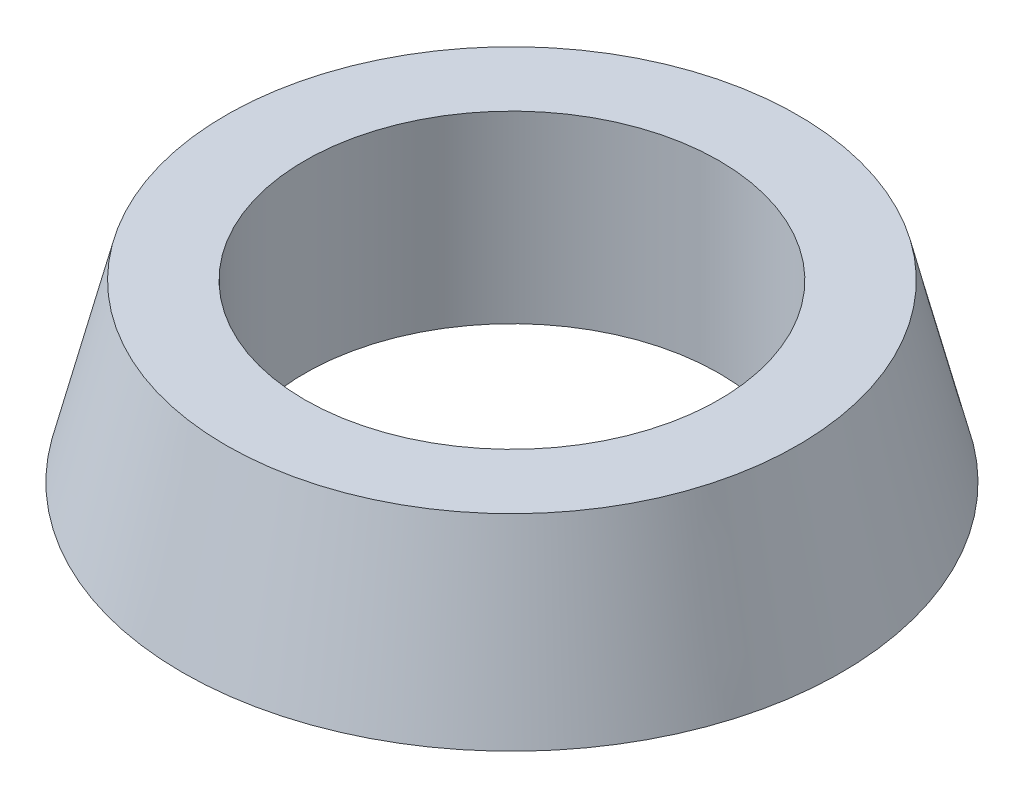
ISO-10303-21;
HEADER;
FILE_DESCRIPTION(('STEP AP214'),'2;1');
FILE_NAME('part.step','',(''),(''),'','','');
FILE_SCHEMA(('AUTOMOTIVE_DESIGN { 1 0 10303 214 1 1 1 1 }'));
ENDSEC;
DATA;
#1=APPLICATION_CONTEXT('core data for automotive mechanical design processes');
#2=APPLICATION_PROTOCOL_DEFINITION('international standard','automotive_design',2000,#1);
#3=PRODUCT_CONTEXT('',#1,'mechanical');
#4=PRODUCT('Part','Part','',(#3));
#5=PRODUCT_RELATED_PRODUCT_CATEGORY('part','',(#4));
#6=PRODUCT_DEFINITION_FORMATION('','',#4);
#7=PRODUCT_DEFINITION_CONTEXT('part definition',#1,'design');
#8=PRODUCT_DEFINITION('design','',#6,#7);
#9=PRODUCT_DEFINITION_SHAPE('','',#8);
#10=(LENGTH_UNIT() NAMED_UNIT(*) SI_UNIT(.MILLI.,.METRE.));
#11=(NAMED_UNIT(*) PLANE_ANGLE_UNIT() SI_UNIT($,.RADIAN.));
#12=(NAMED_UNIT(*) SI_UNIT($,.STERADIAN.) SOLID_ANGLE_UNIT());
#13=UNCERTAINTY_MEASURE_WITH_UNIT(LENGTH_MEASURE(1.E-05),#10,'distance_accuracy_value','');
#14=(GEOMETRIC_REPRESENTATION_CONTEXT(3) GLOBAL_UNCERTAINTY_ASSIGNED_CONTEXT((#13)) GLOBAL_UNIT_ASSIGNED_CONTEXT((#10,
#11,#12)) REPRESENTATION_CONTEXT('',''));
#15=CARTESIAN_POINT('',(0.,0.,0.));
#16=DIRECTION('',(0.,0.,1.));
#17=DIRECTION('',(1.,0.,0.));
#18=AXIS2_PLACEMENT_3D('',#15,#16,#17);
#19=CARTESIAN_POINT('',(30.3,0.0652829597102846,0.));
#20=DIRECTION('',(0.,1.,0.));
#21=DIRECTION('',(0.,0.,1.));
#22=AXIS2_PLACEMENT_3D('',#19,#20,#21);
#23=PLANE('',#22);
#24=CARTESIAN_POINT('',(0.,0.065282959710285,0.));
#25=DIRECTION('',(0.,1.,0.));
#26=DIRECTION('',(0.,0.,1.));
#27=AXIS2_PLACEMENT_3D('',#24,#25,#26);
#28=CIRCLE('',#27,30.3);
#29=CARTESIAN_POINT('',(0.,0.065282959710285,30.3));
#30=VERTEX_POINT('',#29);
#31=EDGE_CURVE('E55',#30,#30,#28,.T.);
#32=ORIENTED_EDGE('',*,*,#31,.F.);
#33=EDGE_LOOP('',(#32));
#34=FACE_BOUND('',#33,.T.);
#35=CARTESIAN_POINT('',(0.,0.0652829597102842,0.));
#36=DIRECTION('',(0.,1.,0.));
#37=DIRECTION('',(0.,0.,1.));
#38=AXIS2_PLACEMENT_3D('',#35,#36,#37);
#39=CIRCLE('',#38,22.5);
#40=CARTESIAN_POINT('',(0.,0.0652829597102842,22.5));
#41=VERTEX_POINT('',#40);
#42=EDGE_CURVE('E10',#41,#41,#39,.T.);
#43=ORIENTED_EDGE('',*,*,#42,.T.);
#44=EDGE_LOOP('',(#43));
#45=FACE_BOUND('',#44,.T.);
#46=ADVANCED_FACE('F33',(#34,#45),#23,.F.);
#47=CARTESIAN_POINT('',(0.,0.,0.));
#48=DIRECTION('',(0.,1.,0.));
#49=DIRECTION('',(0.,0.,1.));
#50=AXIS2_PLACEMENT_3D('',#47,#48,#49);
#51=CYLINDRICAL_SURFACE('',#50,22.5);
#52=ORIENTED_EDGE('',*,*,#42,.F.);
#53=EDGE_LOOP('',(#52));
#54=FACE_BOUND('',#53,.T.);
#55=CARTESIAN_POINT('',(0.,20.0652829597103,0.));
#56=DIRECTION('',(0.,1.,0.));
#57=DIRECTION('',(0.,0.,1.));
#58=AXIS2_PLACEMENT_3D('',#55,#56,#57);
#59=CIRCLE('',#58,22.5);
#60=CARTESIAN_POINT('',(0.,20.0652829597103,22.5));
#61=VERTEX_POINT('',#60);
#62=EDGE_CURVE('E39',#61,#61,#59,.T.);
#63=ORIENTED_EDGE('',*,*,#62,.T.);
#64=EDGE_LOOP('',(#63));
#65=FACE_BOUND('',#64,.T.);
#66=ADVANCED_FACE('F62',(#54,#65),#51,.F.);
#67=CARTESIAN_POINT('',(22.5,20.0652829597103,0.));
#68=DIRECTION('',(0.,-1.,0.));
#69=DIRECTION('',(0.,0.,-1.));
#70=AXIS2_PLACEMENT_3D('',#67,#68,#69);
#71=PLANE('',#70);
#72=ORIENTED_EDGE('',*,*,#62,.F.);
#73=EDGE_LOOP('',(#72));
#74=FACE_BOUND('',#73,.T.);
#75=CARTESIAN_POINT('',(0.,20.0652829597103,0.));
#76=DIRECTION('',(0.,1.,0.));
#77=DIRECTION('',(0.,0.,1.));
#78=AXIS2_PLACEMENT_3D('',#75,#76,#77);
#79=CIRCLE('',#78,31.0627679459796);
#80=CARTESIAN_POINT('',(0.,20.0652829597103,31.0627679459796));
#81=VERTEX_POINT('',#80);
#82=EDGE_CURVE('E43',#81,#81,#79,.T.);
#83=ORIENTED_EDGE('',*,*,#82,.T.);
#84=EDGE_LOOP('',(#83));
#85=FACE_BOUND('',#84,.T.);
#86=ADVANCED_FACE('F66',(#74,#85),#71,.F.);
#87=CARTESIAN_POINT('',(0.,1.06528295971029,0.));
#88=DIRECTION('',(0.,-1.,0.));
#89=DIRECTION('',(0.,0.,-1.));
#90=AXIS2_PLACEMENT_3D('',#87,#88,#89);
#91=CONICAL_SURFACE('',#90,35.8,0.244346095279204);
#92=ORIENTED_EDGE('',*,*,#82,.F.);
#93=EDGE_LOOP('',(#92));
#94=FACE_BOUND('',#93,.T.);
#95=CARTESIAN_POINT('',(0.,1.06528295971029,0.));
#96=DIRECTION('',(0.,1.,0.));
#97=DIRECTION('',(0.,0.,1.));
#98=AXIS2_PLACEMENT_3D('',#95,#96,#97);
#99=CIRCLE('',#98,35.8);
#100=CARTESIAN_POINT('',(0.,1.06528295971029,35.8));
#101=VERTEX_POINT('',#100);
#102=EDGE_CURVE('E47',#101,#101,#99,.T.);
#103=ORIENTED_EDGE('',*,*,#102,.T.);
#104=EDGE_LOOP('',(#103));
#105=FACE_BOUND('',#104,.T.);
#106=ADVANCED_FACE('F71',(#94,#105),#91,.T.);
#107=CARTESIAN_POINT('',(35.8,1.06528295971029,0.));
#108=DIRECTION('',(0.,1.,0.));
#109=DIRECTION('',(0.,0.,1.));
#110=AXIS2_PLACEMENT_3D('',#107,#108,#109);
#111=PLANE('',#110);
#112=ORIENTED_EDGE('',*,*,#102,.F.);
#113=EDGE_LOOP('',(#112));
#114=FACE_BOUND('',#113,.T.);
#115=CARTESIAN_POINT('',(0.,1.06528295971029,0.));
#116=DIRECTION('',(0.,1.,0.));
#117=DIRECTION('',(0.,0.,1.));
#118=AXIS2_PLACEMENT_3D('',#115,#116,#117);
#119=CIRCLE('',#118,30.3);
#120=CARTESIAN_POINT('',(0.,1.06528295971029,30.3));
#121=VERTEX_POINT('',#120);
#122=EDGE_CURVE('E52',#121,#121,#119,.T.);
#123=ORIENTED_EDGE('',*,*,#122,.T.);
#124=EDGE_LOOP('',(#123));
#125=FACE_BOUND('',#124,.T.);
#126=ADVANCED_FACE('F77',(#114,#125),#111,.F.);
#127=CARTESIAN_POINT('',(0.,0.,0.));
#128=DIRECTION('',(0.,1.,0.));
#129=DIRECTION('',(0.,0.,1.));
#130=AXIS2_PLACEMENT_3D('',#127,#128,#129);
#131=CYLINDRICAL_SURFACE('',#130,30.3);
#132=ORIENTED_EDGE('',*,*,#122,.F.);
#133=EDGE_LOOP('',(#132));
#134=FACE_BOUND('',#133,.T.);
#135=ORIENTED_EDGE('',*,*,#31,.T.);
#136=EDGE_LOOP('',(#135));
#137=FACE_BOUND('',#136,.T.);
#138=ADVANCED_FACE('F59',(#134,#137),#131,.T.);
#139=CLOSED_SHELL('',(#46,#66,#86,#106,#126,#138));
#140=MANIFOLD_SOLID_BREP('B2',#139);
#141=ADVANCED_BREP_SHAPE_REPRESENTATION('',(#18,#140),#14);
#142=SHAPE_DEFINITION_REPRESENTATION(#9,#141);
ENDSEC;
END-ISO-10303-21;
